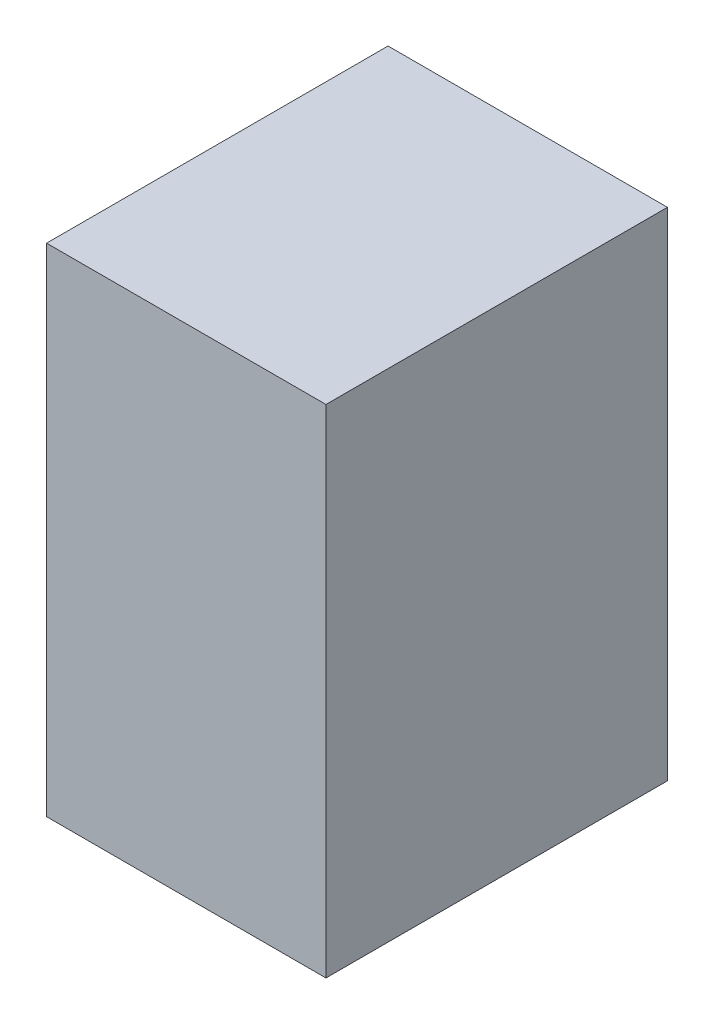
ISO-10303-21;
HEADER;
FILE_DESCRIPTION(('STEP AP214'),'2;1');
FILE_NAME('part.step','',(''),(''),'','','');
FILE_SCHEMA(('AUTOMOTIVE_DESIGN { 1 0 10303 214 1 1 1 1 }'));
ENDSEC;
DATA;
#1=APPLICATION_CONTEXT('core data for automotive mechanical design processes');
#2=APPLICATION_PROTOCOL_DEFINITION('international standard','automotive_design',2000,#1);
#3=PRODUCT_CONTEXT('',#1,'mechanical');
#4=PRODUCT('Part','Part','',(#3));
#5=PRODUCT_RELATED_PRODUCT_CATEGORY('part','',(#4));
#6=PRODUCT_DEFINITION_FORMATION('','',#4);
#7=PRODUCT_DEFINITION_CONTEXT('part definition',#1,'design');
#8=PRODUCT_DEFINITION('design','',#6,#7);
#9=PRODUCT_DEFINITION_SHAPE('','',#8);
#10=(LENGTH_UNIT() NAMED_UNIT(*) SI_UNIT(.MILLI.,.METRE.));
#11=(NAMED_UNIT(*) PLANE_ANGLE_UNIT() SI_UNIT($,.RADIAN.));
#12=(NAMED_UNIT(*) SI_UNIT($,.STERADIAN.) SOLID_ANGLE_UNIT());
#13=UNCERTAINTY_MEASURE_WITH_UNIT(LENGTH_MEASURE(1.E-05),#10,'distance_accuracy_value','');
#14=(GEOMETRIC_REPRESENTATION_CONTEXT(3) GLOBAL_UNCERTAINTY_ASSIGNED_CONTEXT((#13)) GLOBAL_UNIT_ASSIGNED_CONTEXT((#10,
#11,#12)) REPRESENTATION_CONTEXT('',''));
#15=CARTESIAN_POINT('',(0.,0.,0.));
#16=DIRECTION('',(0.,0.,1.));
#17=DIRECTION('',(1.,0.,0.));
#18=AXIS2_PLACEMENT_3D('',#15,#16,#17);
#19=CARTESIAN_POINT('',(0.,800.,0.));
#20=DIRECTION('',(1.,0.,0.));
#21=DIRECTION('',(0.,0.,-1.));
#22=AXIS2_PLACEMENT_3D('',#19,#20,#21);
#23=PLANE('',#22);
#24=DIRECTION('',(0.,0.,1.));
#25=VECTOR('',#24,1.);
#26=CARTESIAN_POINT('',(0.,0.,0.));
#27=LINE('',#26,#25);
#28=CARTESIAN_POINT('',(0.,0.,-550.));
#29=VERTEX_POINT('',#28);
#30=CARTESIAN_POINT('',(0.,0.,0.));
#31=VERTEX_POINT('',#30);
#32=EDGE_CURVE('E99',#29,#31,#27,.T.);
#33=ORIENTED_EDGE('',*,*,#32,.T.);
#34=DIRECTION('',(0.,-1.,0.));
#35=VECTOR('',#34,1.);
#36=CARTESIAN_POINT('',(0.,800.,0.));
#37=LINE('',#36,#35);
#38=CARTESIAN_POINT('',(0.,800.,0.));
#39=VERTEX_POINT('',#38);
#40=EDGE_CURVE('E11',#39,#31,#37,.T.);
#41=ORIENTED_EDGE('',*,*,#40,.F.);
#42=DIRECTION('',(0.,0.,1.));
#43=VECTOR('',#42,1.);
#44=CARTESIAN_POINT('',(0.,800.,0.));
#45=LINE('',#44,#43);
#46=CARTESIAN_POINT('',(0.,800.,-550.));
#47=VERTEX_POINT('',#46);
#48=EDGE_CURVE('E87',#47,#39,#45,.T.);
#49=ORIENTED_EDGE('',*,*,#48,.F.);
#50=DIRECTION('',(0.,-1.,0.));
#51=VECTOR('',#50,1.);
#52=CARTESIAN_POINT('',(0.,800.,-550.));
#53=LINE('',#52,#51);
#54=EDGE_CURVE('E95',#47,#29,#53,.T.);
#55=ORIENTED_EDGE('',*,*,#54,.T.);
#56=EDGE_LOOP('',(#33,#41,#49,#55));
#57=FACE_BOUND('',#56,.T.);
#58=ADVANCED_FACE('F36',(#57),#23,.F.);
#59=CARTESIAN_POINT('',(0.,800.,0.));
#60=DIRECTION('',(0.,0.,-1.));
#61=DIRECTION('',(-1.,0.,0.));
#62=AXIS2_PLACEMENT_3D('',#59,#60,#61);
#63=PLANE('',#62);
#64=DIRECTION('',(1.,0.,0.));
#65=VECTOR('',#64,1.);
#66=CARTESIAN_POINT('',(0.,0.,0.));
#67=LINE('',#66,#65);
#68=CARTESIAN_POINT('',(450.,0.,0.));
#69=VERTEX_POINT('',#68);
#70=EDGE_CURVE('E91',#31,#69,#67,.T.);
#71=ORIENTED_EDGE('',*,*,#70,.T.);
#72=DIRECTION('',(0.,-1.,0.));
#73=VECTOR('',#72,1.);
#74=CARTESIAN_POINT('',(450.,800.,0.));
#75=LINE('',#74,#73);
#76=CARTESIAN_POINT('',(450.,800.,0.));
#77=VERTEX_POINT('',#76);
#78=EDGE_CURVE('E44',#77,#69,#75,.T.);
#79=ORIENTED_EDGE('',*,*,#78,.F.);
#80=DIRECTION('',(1.,0.,0.));
#81=VECTOR('',#80,1.);
#82=CARTESIAN_POINT('',(0.,800.,0.));
#83=LINE('',#82,#81);
#84=EDGE_CURVE('E82',#39,#77,#83,.T.);
#85=ORIENTED_EDGE('',*,*,#84,.F.);
#86=ORIENTED_EDGE('',*,*,#40,.T.);
#87=EDGE_LOOP('',(#71,#79,#85,#86));
#88=FACE_BOUND('',#87,.T.);
#89=ADVANCED_FACE('F90',(#88),#63,.F.);
#90=CARTESIAN_POINT('',(450.,800.,0.));
#91=DIRECTION('',(-1.,0.,0.));
#92=DIRECTION('',(0.,0.,1.));
#93=AXIS2_PLACEMENT_3D('',#90,#91,#92);
#94=PLANE('',#93);
#95=DIRECTION('',(0.,0.,-1.));
#96=VECTOR('',#95,1.);
#97=CARTESIAN_POINT('',(450.,0.,0.));
#98=LINE('',#97,#96);
#99=CARTESIAN_POINT('',(450.,0.,-550.));
#100=VERTEX_POINT('',#99);
#101=EDGE_CURVE('E69',#69,#100,#98,.T.);
#102=ORIENTED_EDGE('',*,*,#101,.T.);
#103=DIRECTION('',(0.,-1.,0.));
#104=VECTOR('',#103,1.);
#105=CARTESIAN_POINT('',(450.,800.,-550.));
#106=LINE('',#105,#104);
#107=CARTESIAN_POINT('',(450.,800.,-550.));
#108=VERTEX_POINT('',#107);
#109=EDGE_CURVE('E92',#108,#100,#106,.T.);
#110=ORIENTED_EDGE('',*,*,#109,.F.);
#111=DIRECTION('',(0.,0.,-1.));
#112=VECTOR('',#111,1.);
#113=CARTESIAN_POINT('',(450.,800.,0.));
#114=LINE('',#113,#112);
#115=EDGE_CURVE('E85',#77,#108,#114,.T.);
#116=ORIENTED_EDGE('',*,*,#115,.F.);
#117=ORIENTED_EDGE('',*,*,#78,.T.);
#118=EDGE_LOOP('',(#102,#110,#116,#117));
#119=FACE_BOUND('',#118,.T.);
#120=ADVANCED_FACE('F93',(#119),#94,.F.);
#121=CARTESIAN_POINT('',(0.,800.,-550.));
#122=DIRECTION('',(0.,0.,1.));
#123=DIRECTION('',(1.,0.,0.));
#124=AXIS2_PLACEMENT_3D('',#121,#122,#123);
#125=PLANE('',#124);
#126=DIRECTION('',(-1.,0.,0.));
#127=VECTOR('',#126,1.);
#128=CARTESIAN_POINT('',(0.,0.,-550.));
#129=LINE('',#128,#127);
#130=EDGE_CURVE('E75',#100,#29,#129,.T.);
#131=ORIENTED_EDGE('',*,*,#130,.T.);
#132=ORIENTED_EDGE('',*,*,#54,.F.);
#133=DIRECTION('',(-1.,0.,0.));
#134=VECTOR('',#133,1.);
#135=CARTESIAN_POINT('',(0.,800.,-550.));
#136=LINE('',#135,#134);
#137=EDGE_CURVE('E52',#108,#47,#136,.T.);
#138=ORIENTED_EDGE('',*,*,#137,.F.);
#139=ORIENTED_EDGE('',*,*,#109,.T.);
#140=EDGE_LOOP('',(#131,#132,#138,#139));
#141=FACE_BOUND('',#140,.T.);
#142=ADVANCED_FACE('F106',(#141),#125,.F.);
#143=CARTESIAN_POINT('',(0.,800.,0.));
#144=DIRECTION('',(0.,-1.,0.));
#145=DIRECTION('',(0.,0.,-1.));
#146=AXIS2_PLACEMENT_3D('',#143,#144,#145);
#147=PLANE('',#146);
#148=ORIENTED_EDGE('',*,*,#48,.T.);
#149=ORIENTED_EDGE('',*,*,#84,.T.);
#150=ORIENTED_EDGE('',*,*,#115,.T.);
#151=ORIENTED_EDGE('',*,*,#137,.T.);
#152=EDGE_LOOP('',(#148,#149,#150,#151));
#153=FACE_BOUND('',#152,.T.);
#154=ADVANCED_FACE('F83',(#153),#147,.F.);
#155=CARTESIAN_POINT('',(0.,0.,0.));
#156=DIRECTION('',(0.,-1.,0.));
#157=DIRECTION('',(0.,0.,-1.));
#158=AXIS2_PLACEMENT_3D('',#155,#156,#157);
#159=PLANE('',#158);
#160=ORIENTED_EDGE('',*,*,#32,.F.);
#161=ORIENTED_EDGE('',*,*,#130,.F.);
#162=ORIENTED_EDGE('',*,*,#101,.F.);
#163=ORIENTED_EDGE('',*,*,#70,.F.);
#164=EDGE_LOOP('',(#160,#161,#162,#163));
#165=FACE_BOUND('',#164,.T.);
#166=ADVANCED_FACE('F109',(#165),#159,.T.);
#167=CLOSED_SHELL('',(#58,#89,#120,#142,#154,#166));
#168=MANIFOLD_SOLID_BREP('B2',#167);
#169=ADVANCED_BREP_SHAPE_REPRESENTATION('',(#18,#168),#14);
#170=SHAPE_DEFINITION_REPRESENTATION(#9,#169);
ENDSEC;
END-ISO-10303-21;
